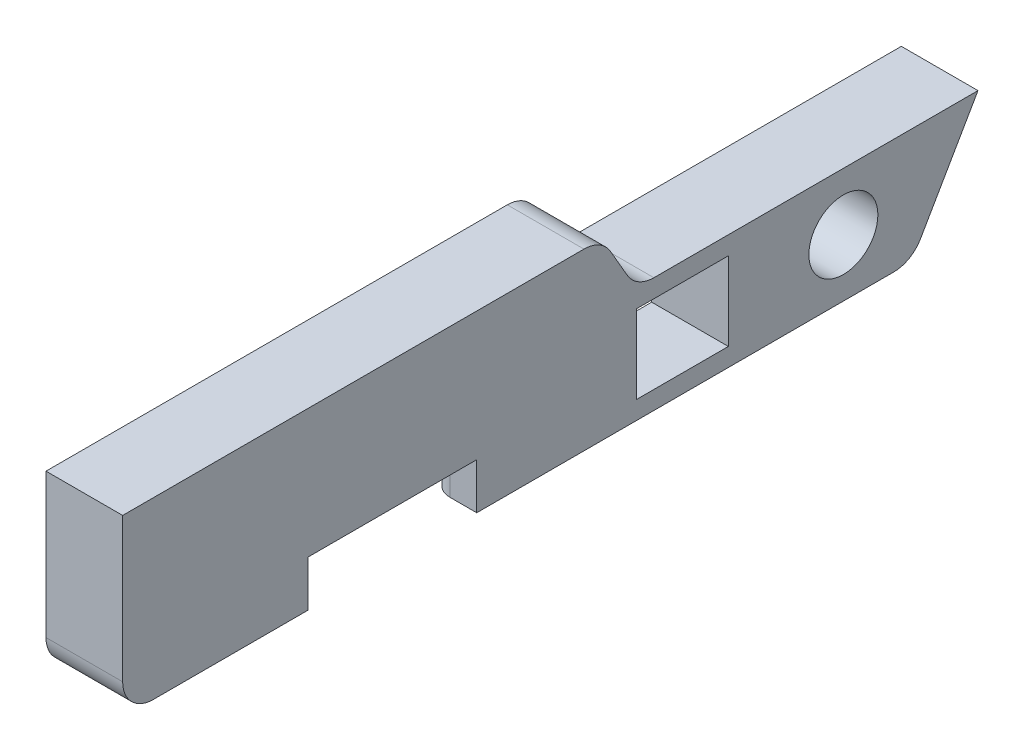
ISO-10303-21;
HEADER;
FILE_DESCRIPTION(('STEP AP214'),'2;1');
FILE_NAME('part.step','',(''),(''),'','','');
FILE_SCHEMA(('AUTOMOTIVE_DESIGN { 1 0 10303 214 1 1 1 1 }'));
ENDSEC;
DATA;
#1=APPLICATION_CONTEXT('core data for automotive mechanical design processes');
#2=APPLICATION_PROTOCOL_DEFINITION('international standard','automotive_design',2000,#1);
#3=PRODUCT_CONTEXT('',#1,'mechanical');
#4=PRODUCT('Part','Part','',(#3));
#5=PRODUCT_RELATED_PRODUCT_CATEGORY('part','',(#4));
#6=PRODUCT_DEFINITION_FORMATION('','',#4);
#7=PRODUCT_DEFINITION_CONTEXT('part definition',#1,'design');
#8=PRODUCT_DEFINITION('design','',#6,#7);
#9=PRODUCT_DEFINITION_SHAPE('','',#8);
#10=(LENGTH_UNIT() NAMED_UNIT(*) SI_UNIT(.MILLI.,.METRE.));
#11=(NAMED_UNIT(*) PLANE_ANGLE_UNIT() SI_UNIT($,.RADIAN.));
#12=(NAMED_UNIT(*) SI_UNIT($,.STERADIAN.) SOLID_ANGLE_UNIT());
#13=UNCERTAINTY_MEASURE_WITH_UNIT(LENGTH_MEASURE(1.E-05),#10,'distance_accuracy_value','');
#14=(GEOMETRIC_REPRESENTATION_CONTEXT(3) GLOBAL_UNCERTAINTY_ASSIGNED_CONTEXT((#13)) GLOBAL_UNIT_ASSIGNED_CONTEXT((#10,
#11,#12)) REPRESENTATION_CONTEXT('',''));
#15=CARTESIAN_POINT('',(0.,0.,0.));
#16=DIRECTION('',(0.,0.,1.));
#17=DIRECTION('',(1.,0.,0.));
#18=AXIS2_PLACEMENT_3D('',#15,#16,#17);
#19=CARTESIAN_POINT('',(6.35,0.,-63.8750303162584));
#20=DIRECTION('',(0.,1.,0.));
#21=DIRECTION('',(0.,0.,1.));
#22=AXIS2_PLACEMENT_3D('',#19,#20,#21);
#23=PLANE('',#22);
#24=DIRECTION('',(0.,0.,-1.));
#25=VECTOR('',#24,1.);
#26=CARTESIAN_POINT('',(0.,0.,-63.8750303162584));
#27=LINE('',#26,#25);
#28=CARTESIAN_POINT('',(0.,0.,-2.54000000000002));
#29=VERTEX_POINT('',#28);
#30=CARTESIAN_POINT('',(0.,0.,-7.41679999999997));
#31=VERTEX_POINT('',#30);
#32=EDGE_CURVE('E353',#29,#31,#27,.T.);
#33=ORIENTED_EDGE('',*,*,#32,.T.);
#34=CARTESIAN_POINT('',(1.5875,0.,-7.41679999999997));
#35=DIRECTION('',(0.,1.,0.));
#36=DIRECTION('',(0.,0.,1.));
#37=AXIS2_PLACEMENT_3D('',#34,#35,#36);
#38=CIRCLE('',#37,1.5875);
#39=CARTESIAN_POINT('',(1.5875,0.,-9.00429999999997));
#40=VERTEX_POINT('',#39);
#41=EDGE_CURVE('E241',#31,#40,#38,.F.);
#42=ORIENTED_EDGE('',*,*,#41,.T.);
#43=DIRECTION('',(-1.,0.,0.));
#44=VECTOR('',#43,1.);
#45=CARTESIAN_POINT('',(2.54,0.,-9.00429999999997));
#46=LINE('',#45,#44);
#47=CARTESIAN_POINT('',(2.54,0.,-9.00429999999997));
#48=VERTEX_POINT('',#47);
#49=EDGE_CURVE('E234',#48,#40,#46,.T.);
#50=ORIENTED_EDGE('',*,*,#49,.F.);
#51=DIRECTION('',(0.,0.,-1.));
#52=VECTOR('',#51,1.);
#53=CARTESIAN_POINT('',(2.54,0.,-9.00429999999997));
#54=LINE('',#53,#52);
#55=CARTESIAN_POINT('',(2.54,0.,-13.7668));
#56=VERTEX_POINT('',#55);
#57=EDGE_CURVE('E217',#48,#56,#54,.T.);
#58=ORIENTED_EDGE('',*,*,#57,.T.);
#59=CARTESIAN_POINT('',(4.1275,0.,-13.7668));
#60=DIRECTION('',(0.,1.,0.));
#61=DIRECTION('',(0.,0.,1.));
#62=AXIS2_PLACEMENT_3D('',#59,#60,#61);
#63=CIRCLE('',#62,1.5875);
#64=CARTESIAN_POINT('',(4.1275,0.,-15.3543));
#65=VERTEX_POINT('',#64);
#66=EDGE_CURVE('E402',#56,#65,#63,.F.);
#67=ORIENTED_EDGE('',*,*,#66,.T.);
#68=DIRECTION('',(1.,0.,0.));
#69=VECTOR('',#68,1.);
#70=CARTESIAN_POINT('',(0.,0.,-15.3543));
#71=LINE('',#70,#69);
#72=CARTESIAN_POINT('',(6.35,0.,-15.3543));
#73=VERTEX_POINT('',#72);
#74=EDGE_CURVE('E274',#65,#73,#71,.T.);
#75=ORIENTED_EDGE('',*,*,#74,.T.);
#76=DIRECTION('',(0.,0.,-1.));
#77=VECTOR('',#76,1.);
#78=CARTESIAN_POINT('',(6.35,0.,-63.8750303162584));
#79=LINE('',#78,#77);
#80=CARTESIAN_POINT('',(6.35,0.,-2.54000000000002));
#81=VERTEX_POINT('',#80);
#82=EDGE_CURVE('E330',#81,#73,#79,.T.);
#83=ORIENTED_EDGE('',*,*,#82,.F.);
#84=DIRECTION('',(-1.,0.,0.));
#85=VECTOR('',#84,1.);
#86=CARTESIAN_POINT('',(6.35,0.,-2.54000000000002));
#87=LINE('',#86,#85);
#88=EDGE_CURVE('E386',#81,#29,#87,.T.);
#89=ORIENTED_EDGE('',*,*,#88,.T.);
#90=EDGE_LOOP('',(#33,#42,#50,#58,#67,#75,#83,#89));
#91=FACE_BOUND('',#90,.T.);
#92=ADVANCED_FACE('F32',(#91),#23,.F.);
#93=DIRECTION('',(-1.,0.,0.));
#94=VECTOR('',#93,1.);
#95=CARTESIAN_POINT('',(2.54,0.,-33.1343));
#96=LINE('',#95,#94);
#97=CARTESIAN_POINT('',(2.54,0.,-33.1343));
#98=VERTEX_POINT('',#97);
#99=CARTESIAN_POINT('',(1.5875,0.,-33.1343));
#100=VERTEX_POINT('',#99);
#101=EDGE_CURVE('E243',#98,#100,#96,.T.);
#102=ORIENTED_EDGE('',*,*,#101,.T.);
#103=CARTESIAN_POINT('',(1.5875,0.,-34.7218));
#104=DIRECTION('',(0.,1.,0.));
#105=DIRECTION('',(0.,0.,1.));
#106=AXIS2_PLACEMENT_3D('',#103,#104,#105);
#107=CIRCLE('',#106,1.5875);
#108=CARTESIAN_POINT('',(0.,0.,-34.7218));
#109=VERTEX_POINT('',#108);
#110=EDGE_CURVE('E413',#100,#109,#107,.F.);
#111=ORIENTED_EDGE('',*,*,#110,.T.);
#112=CARTESIAN_POINT('',(0.,0.,-63.8750303162584));
#113=VERTEX_POINT('',#112);
#114=EDGE_CURVE('E352',#109,#113,#27,.T.);
#115=ORIENTED_EDGE('',*,*,#114,.T.);
#116=DIRECTION('',(-1.,0.,0.));
#117=VECTOR('',#116,1.);
#118=CARTESIAN_POINT('',(6.35,0.,-63.8750303162584));
#119=LINE('',#118,#117);
#120=CARTESIAN_POINT('',(6.35,0.,-63.8750303162584));
#121=VERTEX_POINT('',#120);
#122=EDGE_CURVE('E383',#121,#113,#119,.T.);
#123=ORIENTED_EDGE('',*,*,#122,.F.);
#124=CARTESIAN_POINT('',(6.35,0.,-29.3243));
#125=VERTEX_POINT('',#124);
#126=EDGE_CURVE('E329',#125,#121,#79,.T.);
#127=ORIENTED_EDGE('',*,*,#126,.F.);
#128=DIRECTION('',(1.,0.,0.));
#129=VECTOR('',#128,1.);
#130=CARTESIAN_POINT('',(0.,0.,-29.3243));
#131=LINE('',#130,#129);
#132=CARTESIAN_POINT('',(4.1275,0.,-29.3243));
#133=VERTEX_POINT('',#132);
#134=EDGE_CURVE('E280',#133,#125,#131,.T.);
#135=ORIENTED_EDGE('',*,*,#134,.F.);
#136=CARTESIAN_POINT('',(4.1275,0.,-30.9118));
#137=DIRECTION('',(0.,1.,0.));
#138=DIRECTION('',(0.,0.,1.));
#139=AXIS2_PLACEMENT_3D('',#136,#137,#138);
#140=CIRCLE('',#139,1.5875);
#141=CARTESIAN_POINT('',(2.54,0.,-30.9118));
#142=VERTEX_POINT('',#141);
#143=EDGE_CURVE('E411',#133,#142,#140,.F.);
#144=ORIENTED_EDGE('',*,*,#143,.T.);
#145=EDGE_CURVE('E228',#142,#98,#54,.T.);
#146=ORIENTED_EDGE('',*,*,#145,.T.);
#147=EDGE_LOOP('',(#102,#111,#115,#123,#127,#135,#144,#146));
#148=FACE_BOUND('',#147,.T.);
#149=ADVANCED_FACE('F479',(#148),#23,.F.);
#150=CARTESIAN_POINT('',(0.,11.9343351826281,-38.2059424427617));
#151=DIRECTION('',(-1.,0.,0.));
#152=DIRECTION('',(0.,0.,1.));
#153=AXIS2_PLACEMENT_3D('',#150,#151,#152);
#154=PLANE('',#153);
#155=DIRECTION('',(0.,-1.,0.));
#156=VECTOR('',#155,1.);
#157=CARTESIAN_POINT('',(0.,8.0137,-42.545));
#158=LINE('',#157,#156);
#159=CARTESIAN_POINT('',(0.,8.0137,-42.545));
#160=VERTEX_POINT('',#159);
#161=CARTESIAN_POINT('',(0.,1.5113,-42.545));
#162=VERTEX_POINT('',#161);
#163=EDGE_CURVE('E289',#160,#162,#158,.T.);
#164=ORIENTED_EDGE('',*,*,#163,.T.);
#165=DIRECTION('',(0.,0.,-1.));
#166=VECTOR('',#165,1.);
#167=CARTESIAN_POINT('',(0.,1.5113,-42.545));
#168=LINE('',#167,#166);
#169=CARTESIAN_POINT('',(0.,1.5113,-50.165));
#170=VERTEX_POINT('',#169);
#171=EDGE_CURVE('E292',#162,#170,#168,.T.);
#172=ORIENTED_EDGE('',*,*,#171,.T.);
#173=DIRECTION('',(0.,1.,0.));
#174=VECTOR('',#173,1.);
#175=CARTESIAN_POINT('',(0.,8.0137,-50.165));
#176=LINE('',#175,#174);
#177=CARTESIAN_POINT('',(0.,8.0137,-50.165));
#178=VERTEX_POINT('',#177);
#179=EDGE_CURVE('E296',#170,#178,#176,.T.);
#180=ORIENTED_EDGE('',*,*,#179,.T.);
#181=DIRECTION('',(0.,0.,1.));
#182=VECTOR('',#181,1.);
#183=CARTESIAN_POINT('',(0.,8.0137,-42.545));
#184=LINE('',#183,#182);
#185=EDGE_CURVE('E299',#178,#160,#184,.T.);
#186=ORIENTED_EDGE('',*,*,#185,.T.);
#187=EDGE_LOOP('',(#164,#172,#180,#186));
#188=FACE_BOUND('',#187,.T.);
#189=CARTESIAN_POINT('',(0.,4.7625,-59.69));
#190=DIRECTION('',(1.,0.,0.));
#191=DIRECTION('',(0.,0.,-1.));
#192=AXIS2_PLACEMENT_3D('',#189,#190,#191);
#193=CIRCLE('',#192,2.85749999999999);
#194=CARTESIAN_POINT('',(0.,4.7625,-62.5475));
#195=VERTEX_POINT('',#194);
#196=EDGE_CURVE('E283',#195,#195,#193,.T.);
#197=ORIENTED_EDGE('',*,*,#196,.T.);
#198=EDGE_LOOP('',(#197));
#199=FACE_BOUND('',#198,.T.);
#200=DIRECTION('',(0.,0.,1.));
#201=VECTOR('',#200,1.);
#202=CARTESIAN_POINT('',(0.,13.2691648721594,-38.2059424427617));
#203=LINE('',#202,#201);
#204=CARTESIAN_POINT('',(0.,13.2691648721594,-34.7218));
#205=VERTEX_POINT('',#204);
#206=CARTESIAN_POINT('',(0.,13.2691648721594,-7.41679999999997));
#207=VERTEX_POINT('',#206);
#208=EDGE_CURVE('E397',#205,#207,#203,.T.);
#209=ORIENTED_EDGE('',*,*,#208,.T.);
#210=DIRECTION('',(0.,-1.,0.));
#211=VECTOR('',#210,1.);
#212=CARTESIAN_POINT('',(0.,11.9343351826281,-7.41679999999997));
#213=LINE('',#212,#211);
#214=EDGE_CURVE('E399',#207,#31,#213,.T.);
#215=ORIENTED_EDGE('',*,*,#214,.T.);
#216=ORIENTED_EDGE('',*,*,#32,.F.);
#217=CARTESIAN_POINT('',(0.,2.54,-2.54));
#218=DIRECTION('',(1.,0.,0.));
#219=DIRECTION('',(0.,0.,-1.));
#220=AXIS2_PLACEMENT_3D('',#217,#218,#219);
#221=CIRCLE('',#220,2.54);
#222=CARTESIAN_POINT('',(0.,2.54000000000002,0.));
#223=VERTEX_POINT('',#222);
#224=EDGE_CURVE('E350',#223,#29,#221,.T.);
#225=ORIENTED_EDGE('',*,*,#224,.F.);
#226=DIRECTION('',(0.,-1.,0.));
#227=VECTOR('',#226,1.);
#228=CARTESIAN_POINT('',(0.,2.54000000000002,0.));
#229=LINE('',#228,#227);
#230=CARTESIAN_POINT('',(0.,14.4743351826281,0.));
#231=VERTEX_POINT('',#230);
#232=EDGE_CURVE('E348',#231,#223,#229,.T.);
#233=ORIENTED_EDGE('',*,*,#232,.F.);
#234=DIRECTION('',(0.,0.,1.));
#235=VECTOR('',#234,1.);
#236=CARTESIAN_POINT('',(0.,14.4743351826281,0.));
#237=LINE('',#236,#235);
#238=CARTESIAN_POINT('',(0.,14.4743351826281,-38.2059424427617));
#239=VERTEX_POINT('',#238);
#240=EDGE_CURVE('E314',#239,#231,#237,.T.);
#241=ORIENTED_EDGE('',*,*,#240,.F.);
#242=CARTESIAN_POINT('',(0.,11.9343351826281,-38.2059424427617));
#243=DIRECTION('',(1.,0.,0.));
#244=DIRECTION('',(0.,0.,1.));
#245=AXIS2_PLACEMENT_3D('',#242,#243,#244);
#246=CIRCLE('',#245,2.54);
#247=CARTESIAN_POINT('',(0.,13.2043351826281,-40.4056469683742));
#248=VERTEX_POINT('',#247);
#249=EDGE_CURVE('E325',#248,#239,#246,.T.);
#250=ORIENTED_EDGE('',*,*,#249,.F.);
#251=DIRECTION('',(0.,0.866025403784438,0.500000000000001));
#252=VECTOR('',#251,1.);
#253=CARTESIAN_POINT('',(0.,13.2043351826281,-40.4056469683742));
#254=LINE('',#253,#252);
#255=CARTESIAN_POINT('',(0.,10.795,-41.7966772846325));
#256=VERTEX_POINT('',#255);
#257=EDGE_CURVE('E363',#256,#248,#254,.T.);
#258=ORIENTED_EDGE('',*,*,#257,.F.);
#259=CARTESIAN_POINT('',(0.,12.065,-43.996381810245));
#260=DIRECTION('',(-1.,0.,0.));
#261=DIRECTION('',(0.,0.,-1.));
#262=AXIS2_PLACEMENT_3D('',#259,#260,#261);
#263=CIRCLE('',#262,2.54);
#264=CARTESIAN_POINT('',(0.,9.525,-43.996381810245));
#265=VERTEX_POINT('',#264);
#266=EDGE_CURVE('E361',#265,#256,#263,.T.);
#267=ORIENTED_EDGE('',*,*,#266,.F.);
#268=DIRECTION('',(0.,0.,1.));
#269=VECTOR('',#268,1.);
#270=CARTESIAN_POINT('',(0.,9.525,-43.996381810245));
#271=LINE('',#270,#269);
#272=CARTESIAN_POINT('',(0.,9.525,-70.8407613140312));
#273=VERTEX_POINT('',#272);
#274=EDGE_CURVE('E359',#273,#265,#271,.T.);
#275=ORIENTED_EDGE('',*,*,#274,.F.);
#276=DIRECTION('',(0.,0.866025403784439,-0.5));
#277=VECTOR('',#276,1.);
#278=CARTESIAN_POINT('',(0.,9.525,-70.8407613140312));
#279=LINE('',#278,#277);
#280=CARTESIAN_POINT('',(0.,1.27,-66.0747348418709));
#281=VERTEX_POINT('',#280);
#282=EDGE_CURVE('E357',#281,#273,#279,.T.);
#283=ORIENTED_EDGE('',*,*,#282,.F.);
#284=CARTESIAN_POINT('',(0.,2.54,-63.8750303162584));
#285=DIRECTION('',(1.,0.,0.));
#286=DIRECTION('',(0.,0.,1.));
#287=AXIS2_PLACEMENT_3D('',#284,#285,#286);
#288=CIRCLE('',#287,2.54);
#289=EDGE_CURVE('E355',#113,#281,#288,.T.);
#290=ORIENTED_EDGE('',*,*,#289,.F.);
#291=ORIENTED_EDGE('',*,*,#114,.F.);
#292=DIRECTION('',(0.,1.,0.));
#293=VECTOR('',#292,1.);
#294=CARTESIAN_POINT('',(0.,11.9343351826281,-34.7218));
#295=LINE('',#294,#293);
#296=EDGE_CURVE('E395',#109,#205,#295,.T.);
#297=ORIENTED_EDGE('',*,*,#296,.T.);
#298=EDGE_LOOP('',(#209,#215,#216,#225,#233,#241,#250,#258,#267,#275,#283,#290,#291,#297));
#299=FACE_BOUND('',#298,.T.);
#300=ADVANCED_FACE('F453',(#188,#199,#299),#154,.T.);
#301=CARTESIAN_POINT('',(0.,3.81,-15.3543));
#302=DIRECTION('',(0.,1.,0.));
#303=DIRECTION('',(0.,0.,1.));
#304=AXIS2_PLACEMENT_3D('',#301,#302,#303);
#305=PLANE('',#304);
#306=DIRECTION('',(0.,0.,-1.));
#307=VECTOR('',#306,1.);
#308=CARTESIAN_POINT('',(5.334,3.81,-7.98829999999997));
#309=LINE('',#308,#307);
#310=CARTESIAN_POINT('',(5.334,3.81,-15.3543));
#311=VERTEX_POINT('',#310);
#312=CARTESIAN_POINT('',(5.334,3.81,-29.3243));
#313=VERTEX_POINT('',#312);
#314=EDGE_CURVE('E242',#311,#313,#309,.T.);
#315=ORIENTED_EDGE('',*,*,#314,.T.);
#316=DIRECTION('',(1.,0.,0.));
#317=VECTOR('',#316,1.);
#318=CARTESIAN_POINT('',(0.,3.81,-29.3243));
#319=LINE('',#318,#317);
#320=CARTESIAN_POINT('',(6.35,3.81,-29.3243));
#321=VERTEX_POINT('',#320);
#322=EDGE_CURVE('E278',#313,#321,#319,.T.);
#323=ORIENTED_EDGE('',*,*,#322,.T.);
#324=DIRECTION('',(0.,0.,1.));
#325=VECTOR('',#324,1.);
#326=CARTESIAN_POINT('',(6.35,3.81,-15.3543));
#327=LINE('',#326,#325);
#328=CARTESIAN_POINT('',(6.35,3.81,-15.3543));
#329=VERTEX_POINT('',#328);
#330=EDGE_CURVE('E271',#321,#329,#327,.T.);
#331=ORIENTED_EDGE('',*,*,#330,.T.);
#332=DIRECTION('',(1.,0.,0.));
#333=VECTOR('',#332,1.);
#334=CARTESIAN_POINT('',(0.,3.81,-15.3543));
#335=LINE('',#334,#333);
#336=EDGE_CURVE('E275',#311,#329,#335,.T.);
#337=ORIENTED_EDGE('',*,*,#336,.F.);
#338=EDGE_LOOP('',(#315,#323,#331,#337));
#339=FACE_BOUND('',#338,.T.);
#340=ADVANCED_FACE('F495',(#339),#305,.F.);
#341=CARTESIAN_POINT('',(6.35,14.4743351826281,0.));
#342=DIRECTION('',(0.,-1.,0.));
#343=DIRECTION('',(0.,0.,-1.));
#344=AXIS2_PLACEMENT_3D('',#341,#342,#343);
#345=PLANE('',#344);
#346=ORIENTED_EDGE('',*,*,#240,.T.);
#347=DIRECTION('',(-1.,0.,0.));
#348=VECTOR('',#347,1.);
#349=CARTESIAN_POINT('',(6.35,14.4743351826281,0.));
#350=LINE('',#349,#348);
#351=CARTESIAN_POINT('',(6.35,14.4743351826281,0.));
#352=VERTEX_POINT('',#351);
#353=EDGE_CURVE('E392',#352,#231,#350,.T.);
#354=ORIENTED_EDGE('',*,*,#353,.F.);
#355=DIRECTION('',(0.,0.,1.));
#356=VECTOR('',#355,1.);
#357=CARTESIAN_POINT('',(6.35,14.4743351826281,0.));
#358=LINE('',#357,#356);
#359=CARTESIAN_POINT('',(6.35,14.4743351826281,-38.2059424427617));
#360=VERTEX_POINT('',#359);
#361=EDGE_CURVE('E321',#360,#352,#358,.T.);
#362=ORIENTED_EDGE('',*,*,#361,.F.);
#363=DIRECTION('',(-1.,0.,0.));
#364=VECTOR('',#363,1.);
#365=CARTESIAN_POINT('',(6.35,14.4743351826281,-38.2059424427617));
#366=LINE('',#365,#364);
#367=EDGE_CURVE('E345',#360,#239,#366,.T.);
#368=ORIENTED_EDGE('',*,*,#367,.T.);
#369=EDGE_LOOP('',(#346,#354,#362,#368));
#370=FACE_BOUND('',#369,.T.);
#371=ADVANCED_FACE('F525',(#370),#345,.F.);
#372=CARTESIAN_POINT('',(6.35,2.54000000000002,0.));
#373=DIRECTION('',(0.,0.,-1.));
#374=DIRECTION('',(-1.,0.,0.));
#375=AXIS2_PLACEMENT_3D('',#372,#373,#374);
#376=PLANE('',#375);
#377=ORIENTED_EDGE('',*,*,#232,.T.);
#378=DIRECTION('',(-1.,0.,0.));
#379=VECTOR('',#378,1.);
#380=CARTESIAN_POINT('',(6.35,2.54000000000002,0.));
#381=LINE('',#380,#379);
#382=CARTESIAN_POINT('',(6.35,2.54000000000002,0.));
#383=VERTEX_POINT('',#382);
#384=EDGE_CURVE('E389',#383,#223,#381,.T.);
#385=ORIENTED_EDGE('',*,*,#384,.F.);
#386=DIRECTION('',(0.,-1.,0.));
#387=VECTOR('',#386,1.);
#388=CARTESIAN_POINT('',(6.35,2.54000000000002,0.));
#389=LINE('',#388,#387);
#390=EDGE_CURVE('E324',#352,#383,#389,.T.);
#391=ORIENTED_EDGE('',*,*,#390,.F.);
#392=ORIENTED_EDGE('',*,*,#353,.T.);
#393=EDGE_LOOP('',(#377,#385,#391,#392));
#394=FACE_BOUND('',#393,.T.);
#395=ADVANCED_FACE('F522',(#394),#376,.F.);
#396=CARTESIAN_POINT('',(6.35,2.54,-2.54));
#397=DIRECTION('',(-1.,0.,0.));
#398=DIRECTION('',(0.,0.,1.));
#399=AXIS2_PLACEMENT_3D('',#396,#397,#398);
#400=CYLINDRICAL_SURFACE('',#399,2.54);
#401=ORIENTED_EDGE('',*,*,#224,.T.);
#402=ORIENTED_EDGE('',*,*,#88,.F.);
#403=CARTESIAN_POINT('',(6.35,2.54,-2.54));
#404=DIRECTION('',(1.,0.,0.));
#405=DIRECTION('',(0.,0.,-1.));
#406=AXIS2_PLACEMENT_3D('',#403,#404,#405);
#407=CIRCLE('',#406,2.54);
#408=EDGE_CURVE('E327',#383,#81,#407,.T.);
#409=ORIENTED_EDGE('',*,*,#408,.F.);
#410=ORIENTED_EDGE('',*,*,#384,.T.);
#411=EDGE_LOOP('',(#401,#402,#409,#410));
#412=FACE_BOUND('',#411,.T.);
#413=ADVANCED_FACE('F519',(#412),#400,.T.);
#414=CARTESIAN_POINT('',(6.35,2.54,-63.8750303162584));
#415=DIRECTION('',(-1.,0.,0.));
#416=DIRECTION('',(0.,0.,1.));
#417=AXIS2_PLACEMENT_3D('',#414,#415,#416);
#418=CYLINDRICAL_SURFACE('',#417,2.54);
#419=ORIENTED_EDGE('',*,*,#289,.T.);
#420=DIRECTION('',(-1.,0.,0.));
#421=VECTOR('',#420,1.);
#422=CARTESIAN_POINT('',(6.35,1.27,-66.0747348418709));
#423=LINE('',#422,#421);
#424=CARTESIAN_POINT('',(6.35,1.27,-66.0747348418709));
#425=VERTEX_POINT('',#424);
#426=EDGE_CURVE('E380',#425,#281,#423,.T.);
#427=ORIENTED_EDGE('',*,*,#426,.F.);
#428=CARTESIAN_POINT('',(6.35,2.54,-63.8750303162584));
#429=DIRECTION('',(1.,0.,0.));
#430=DIRECTION('',(0.,0.,1.));
#431=AXIS2_PLACEMENT_3D('',#428,#429,#430);
#432=CIRCLE('',#431,2.54);
#433=EDGE_CURVE('E333',#121,#425,#432,.T.);
#434=ORIENTED_EDGE('',*,*,#433,.F.);
#435=ORIENTED_EDGE('',*,*,#122,.T.);
#436=EDGE_LOOP('',(#419,#427,#434,#435));
#437=FACE_BOUND('',#436,.T.);
#438=ADVANCED_FACE('F517',(#437),#418,.T.);
#439=CARTESIAN_POINT('',(6.35,9.525,-70.8407613140312));
#440=DIRECTION('',(0.,0.5,0.866025403784439));
#441=DIRECTION('',(0.,-0.866025403784439,0.5));
#442=AXIS2_PLACEMENT_3D('',#439,#440,#441);
#443=PLANE('',#442);
#444=ORIENTED_EDGE('',*,*,#282,.T.);
#445=DIRECTION('',(-1.,0.,0.));
#446=VECTOR('',#445,1.);
#447=CARTESIAN_POINT('',(6.35,9.525,-70.8407613140312));
#448=LINE('',#447,#446);
#449=CARTESIAN_POINT('',(6.35,9.525,-70.8407613140312));
#450=VERTEX_POINT('',#449);
#451=EDGE_CURVE('E377',#450,#273,#448,.T.);
#452=ORIENTED_EDGE('',*,*,#451,.F.);
#453=DIRECTION('',(0.,0.866025403784439,-0.5));
#454=VECTOR('',#453,1.);
#455=CARTESIAN_POINT('',(6.35,9.525,-70.8407613140312));
#456=LINE('',#455,#454);
#457=EDGE_CURVE('E335',#425,#450,#456,.T.);
#458=ORIENTED_EDGE('',*,*,#457,.F.);
#459=ORIENTED_EDGE('',*,*,#426,.T.);
#460=EDGE_LOOP('',(#444,#452,#458,#459));
#461=FACE_BOUND('',#460,.T.);
#462=ADVANCED_FACE('F730',(#461),#443,.F.);
#463=CARTESIAN_POINT('',(6.35,9.525,-43.996381810245));
#464=DIRECTION('',(0.,-1.,0.));
#465=DIRECTION('',(0.,0.,-1.));
#466=AXIS2_PLACEMENT_3D('',#463,#464,#465);
#467=PLANE('',#466);
#468=ORIENTED_EDGE('',*,*,#274,.T.);
#469=DIRECTION('',(-1.,0.,0.));
#470=VECTOR('',#469,1.);
#471=CARTESIAN_POINT('',(6.35,9.525,-43.996381810245));
#472=LINE('',#471,#470);
#473=CARTESIAN_POINT('',(6.35,9.525,-43.996381810245));
#474=VERTEX_POINT('',#473);
#475=EDGE_CURVE('E374',#474,#265,#472,.T.);
#476=ORIENTED_EDGE('',*,*,#475,.F.);
#477=DIRECTION('',(0.,0.,1.));
#478=VECTOR('',#477,1.);
#479=CARTESIAN_POINT('',(6.35,9.525,-43.996381810245));
#480=LINE('',#479,#478);
#481=EDGE_CURVE('E337',#450,#474,#480,.T.);
#482=ORIENTED_EDGE('',*,*,#481,.F.);
#483=ORIENTED_EDGE('',*,*,#451,.T.);
#484=EDGE_LOOP('',(#468,#476,#482,#483));
#485=FACE_BOUND('',#484,.T.);
#486=ADVANCED_FACE('F720',(#485),#467,.F.);
#487=CARTESIAN_POINT('',(6.35,12.065,-43.996381810245));
#488=DIRECTION('',(-1.,0.,0.));
#489=DIRECTION('',(0.,0.,1.));
#490=AXIS2_PLACEMENT_3D('',#487,#488,#489);
#491=CYLINDRICAL_SURFACE('',#490,2.54);
#492=ORIENTED_EDGE('',*,*,#266,.T.);
#493=DIRECTION('',(-1.,0.,0.));
#494=VECTOR('',#493,1.);
#495=CARTESIAN_POINT('',(6.35,10.795,-41.7966772846325));
#496=LINE('',#495,#494);
#497=CARTESIAN_POINT('',(6.35,10.795,-41.7966772846325));
#498=VERTEX_POINT('',#497);
#499=EDGE_CURVE('E371',#498,#256,#496,.T.);
#500=ORIENTED_EDGE('',*,*,#499,.F.);
#501=CARTESIAN_POINT('',(6.35,12.065,-43.996381810245));
#502=DIRECTION('',(-1.,0.,0.));
#503=DIRECTION('',(0.,0.,-1.));
#504=AXIS2_PLACEMENT_3D('',#501,#502,#503);
#505=CIRCLE('',#504,2.54);
#506=EDGE_CURVE('E339',#474,#498,#505,.T.);
#507=ORIENTED_EDGE('',*,*,#506,.F.);
#508=ORIENTED_EDGE('',*,*,#475,.T.);
#509=EDGE_LOOP('',(#492,#500,#507,#508));
#510=FACE_BOUND('',#509,.T.);
#511=ADVANCED_FACE('F710',(#510),#491,.F.);
#512=CARTESIAN_POINT('',(6.35,13.2043351826281,-40.4056469683742));
#513=DIRECTION('',(0.,-0.500000000000001,0.866025403784438));
#514=DIRECTION('',(0.,-0.866025403784438,-0.500000000000001));
#515=AXIS2_PLACEMENT_3D('',#512,#513,#514);
#516=PLANE('',#515);
#517=ORIENTED_EDGE('',*,*,#257,.T.);
#518=DIRECTION('',(-1.,0.,0.));
#519=VECTOR('',#518,1.);
#520=CARTESIAN_POINT('',(6.35,13.2043351826281,-40.4056469683742));
#521=LINE('',#520,#519);
#522=CARTESIAN_POINT('',(6.35,13.2043351826281,-40.4056469683742));
#523=VERTEX_POINT('',#522);
#524=EDGE_CURVE('E368',#523,#248,#521,.T.);
#525=ORIENTED_EDGE('',*,*,#524,.F.);
#526=DIRECTION('',(0.,0.866025403784438,0.500000000000001));
#527=VECTOR('',#526,1.);
#528=CARTESIAN_POINT('',(6.35,13.2043351826281,-40.4056469683742));
#529=LINE('',#528,#527);
#530=EDGE_CURVE('E341',#498,#523,#529,.T.);
#531=ORIENTED_EDGE('',*,*,#530,.F.);
#532=ORIENTED_EDGE('',*,*,#499,.T.);
#533=EDGE_LOOP('',(#517,#525,#531,#532));
#534=FACE_BOUND('',#533,.T.);
#535=ADVANCED_FACE('F700',(#534),#516,.F.);
#536=CARTESIAN_POINT('',(6.35,11.9343351826281,-38.2059424427617));
#537=DIRECTION('',(-1.,0.,0.));
#538=DIRECTION('',(0.,0.,1.));
#539=AXIS2_PLACEMENT_3D('',#536,#537,#538);
#540=CYLINDRICAL_SURFACE('',#539,2.54);
#541=ORIENTED_EDGE('',*,*,#249,.T.);
#542=ORIENTED_EDGE('',*,*,#367,.F.);
#543=CARTESIAN_POINT('',(6.35,11.9343351826281,-38.2059424427617));
#544=DIRECTION('',(1.,0.,0.));
#545=DIRECTION('',(0.,0.,1.));
#546=AXIS2_PLACEMENT_3D('',#543,#544,#545);
#547=CIRCLE('',#546,2.54);
#548=EDGE_CURVE('E343',#523,#360,#547,.T.);
#549=ORIENTED_EDGE('',*,*,#548,.F.);
#550=ORIENTED_EDGE('',*,*,#524,.T.);
#551=EDGE_LOOP('',(#541,#542,#549,#550));
#552=FACE_BOUND('',#551,.T.);
#553=ADVANCED_FACE('F690',(#552),#540,.T.);
#554=CARTESIAN_POINT('',(6.35,11.9343351826281,-38.2059424427617));
#555=DIRECTION('',(-1.,0.,0.));
#556=DIRECTION('',(0.,0.,1.));
#557=AXIS2_PLACEMENT_3D('',#554,#555,#556);
#558=PLANE('',#557);
#559=CARTESIAN_POINT('',(6.35,4.7625,-59.69));
#560=DIRECTION('',(1.,0.,0.));
#561=DIRECTION('',(0.,0.,-1.));
#562=AXIS2_PLACEMENT_3D('',#559,#560,#561);
#563=CIRCLE('',#562,2.85749999999999);
#564=CARTESIAN_POINT('',(6.35,4.7625,-62.5475));
#565=VERTEX_POINT('',#564);
#566=EDGE_CURVE('E277',#565,#565,#563,.T.);
#567=ORIENTED_EDGE('',*,*,#566,.F.);
#568=EDGE_LOOP('',(#567));
#569=FACE_BOUND('',#568,.T.);
#570=DIRECTION('',(0.,0.,-1.));
#571=VECTOR('',#570,1.);
#572=CARTESIAN_POINT('',(6.35,1.5113,-42.545));
#573=LINE('',#572,#571);
#574=CARTESIAN_POINT('',(6.35,1.5113,-42.545));
#575=VERTEX_POINT('',#574);
#576=CARTESIAN_POINT('',(6.35,1.5113,-50.165));
#577=VERTEX_POINT('',#576);
#578=EDGE_CURVE('E304',#575,#577,#573,.T.);
#579=ORIENTED_EDGE('',*,*,#578,.F.);
#580=DIRECTION('',(0.,-1.,0.));
#581=VECTOR('',#580,1.);
#582=CARTESIAN_POINT('',(6.35,8.0137,-42.545));
#583=LINE('',#582,#581);
#584=CARTESIAN_POINT('',(6.35,8.0137,-42.545));
#585=VERTEX_POINT('',#584);
#586=EDGE_CURVE('E286',#585,#575,#583,.T.);
#587=ORIENTED_EDGE('',*,*,#586,.F.);
#588=DIRECTION('',(0.,0.,1.));
#589=VECTOR('',#588,1.);
#590=CARTESIAN_POINT('',(6.35,8.0137,-42.545));
#591=LINE('',#590,#589);
#592=CARTESIAN_POINT('',(6.35,8.0137,-50.165));
#593=VERTEX_POINT('',#592);
#594=EDGE_CURVE('E293',#593,#585,#591,.T.);
#595=ORIENTED_EDGE('',*,*,#594,.F.);
#596=DIRECTION('',(0.,1.,0.));
#597=VECTOR('',#596,1.);
#598=CARTESIAN_POINT('',(6.35,8.0137,-50.165));
#599=LINE('',#598,#597);
#600=EDGE_CURVE('E307',#577,#593,#599,.T.);
#601=ORIENTED_EDGE('',*,*,#600,.F.);
#602=EDGE_LOOP('',(#579,#587,#595,#601));
#603=FACE_BOUND('',#602,.T.);
#604=ORIENTED_EDGE('',*,*,#82,.T.);
#605=DIRECTION('',(0.,-1.,0.));
#606=VECTOR('',#605,1.);
#607=CARTESIAN_POINT('',(6.35,0.,-15.3543));
#608=LINE('',#607,#606);
#609=EDGE_CURVE('E262',#329,#73,#608,.T.);
#610=ORIENTED_EDGE('',*,*,#609,.F.);
#611=ORIENTED_EDGE('',*,*,#330,.F.);
#612=DIRECTION('',(0.,1.,0.));
#613=VECTOR('',#612,1.);
#614=CARTESIAN_POINT('',(6.35,0.,-29.3243));
#615=LINE('',#614,#613);
#616=EDGE_CURVE('E268',#125,#321,#615,.T.);
#617=ORIENTED_EDGE('',*,*,#616,.F.);
#618=ORIENTED_EDGE('',*,*,#126,.T.);
#619=ORIENTED_EDGE('',*,*,#433,.T.);
#620=ORIENTED_EDGE('',*,*,#457,.T.);
#621=ORIENTED_EDGE('',*,*,#481,.T.);
#622=ORIENTED_EDGE('',*,*,#506,.T.);
#623=ORIENTED_EDGE('',*,*,#530,.T.);
#624=ORIENTED_EDGE('',*,*,#548,.T.);
#625=ORIENTED_EDGE('',*,*,#361,.T.);
#626=ORIENTED_EDGE('',*,*,#390,.T.);
#627=ORIENTED_EDGE('',*,*,#408,.T.);
#628=EDGE_LOOP('',(#604,#610,#611,#617,#618,#619,#620,#621,#622,#623,#624,#625,#626,#627));
#629=FACE_BOUND('',#628,.T.);
#630=ADVANCED_FACE('F446',(#569,#603,#629),#558,.F.);
#631=CARTESIAN_POINT('',(0.,8.0137,-42.545));
#632=DIRECTION('',(0.,0.,1.));
#633=DIRECTION('',(1.,0.,0.));
#634=AXIS2_PLACEMENT_3D('',#631,#632,#633);
#635=PLANE('',#634);
#636=ORIENTED_EDGE('',*,*,#586,.T.);
#637=DIRECTION('',(1.,0.,0.));
#638=VECTOR('',#637,1.);
#639=CARTESIAN_POINT('',(0.,1.5113,-42.545));
#640=LINE('',#639,#638);
#641=EDGE_CURVE('E302',#162,#575,#640,.T.);
#642=ORIENTED_EDGE('',*,*,#641,.F.);
#643=ORIENTED_EDGE('',*,*,#163,.F.);
#644=DIRECTION('',(1.,0.,0.));
#645=VECTOR('',#644,1.);
#646=CARTESIAN_POINT('',(0.,8.0137,-42.545));
#647=LINE('',#646,#645);
#648=EDGE_CURVE('E312',#160,#585,#647,.T.);
#649=ORIENTED_EDGE('',*,*,#648,.T.);
#650=EDGE_LOOP('',(#636,#642,#643,#649));
#651=FACE_BOUND('',#650,.T.);
#652=ADVANCED_FACE('F671',(#651),#635,.F.);
#653=CARTESIAN_POINT('',(0.,8.0137,-42.545));
#654=DIRECTION('',(0.,1.,0.));
#655=DIRECTION('',(0.,0.,1.));
#656=AXIS2_PLACEMENT_3D('',#653,#654,#655);
#657=PLANE('',#656);
#658=ORIENTED_EDGE('',*,*,#594,.T.);
#659=ORIENTED_EDGE('',*,*,#648,.F.);
#660=ORIENTED_EDGE('',*,*,#185,.F.);
#661=DIRECTION('',(1.,0.,0.));
#662=VECTOR('',#661,1.);
#663=CARTESIAN_POINT('',(0.,8.0137,-50.165));
#664=LINE('',#663,#662);
#665=EDGE_CURVE('E315',#178,#593,#664,.T.);
#666=ORIENTED_EDGE('',*,*,#665,.T.);
#667=EDGE_LOOP('',(#658,#659,#660,#666));
#668=FACE_BOUND('',#667,.T.);
#669=ADVANCED_FACE('F661',(#668),#657,.F.);
#670=CARTESIAN_POINT('',(0.,8.0137,-50.165));
#671=DIRECTION('',(0.,0.,-1.));
#672=DIRECTION('',(-1.,0.,0.));
#673=AXIS2_PLACEMENT_3D('',#670,#671,#672);
#674=PLANE('',#673);
#675=ORIENTED_EDGE('',*,*,#600,.T.);
#676=ORIENTED_EDGE('',*,*,#665,.F.);
#677=ORIENTED_EDGE('',*,*,#179,.F.);
#678=DIRECTION('',(1.,0.,0.));
#679=VECTOR('',#678,1.);
#680=CARTESIAN_POINT('',(0.,1.5113,-50.165));
#681=LINE('',#680,#679);
#682=EDGE_CURVE('E317',#170,#577,#681,.T.);
#683=ORIENTED_EDGE('',*,*,#682,.T.);
#684=EDGE_LOOP('',(#675,#676,#677,#683));
#685=FACE_BOUND('',#684,.T.);
#686=ADVANCED_FACE('F651',(#685),#674,.F.);
#687=CARTESIAN_POINT('',(0.,1.5113,-42.545));
#688=DIRECTION('',(0.,-1.,0.));
#689=DIRECTION('',(0.,0.,-1.));
#690=AXIS2_PLACEMENT_3D('',#687,#688,#689);
#691=PLANE('',#690);
#692=ORIENTED_EDGE('',*,*,#578,.T.);
#693=ORIENTED_EDGE('',*,*,#682,.F.);
#694=ORIENTED_EDGE('',*,*,#171,.F.);
#695=ORIENTED_EDGE('',*,*,#641,.T.);
#696=EDGE_LOOP('',(#692,#693,#694,#695));
#697=FACE_BOUND('',#696,.T.);
#698=ADVANCED_FACE('F641',(#697),#691,.F.);
#699=CARTESIAN_POINT('',(0.,4.7625,-59.69));
#700=DIRECTION('',(1.,0.,0.));
#701=DIRECTION('',(0.,0.,-1.));
#702=AXIS2_PLACEMENT_3D('',#699,#700,#701);
#703=CYLINDRICAL_SURFACE('',#702,2.85749999999999);
#704=ORIENTED_EDGE('',*,*,#196,.F.);
#705=EDGE_LOOP('',(#704));
#706=FACE_BOUND('',#705,.T.);
#707=ORIENTED_EDGE('',*,*,#566,.T.);
#708=EDGE_LOOP('',(#707));
#709=FACE_BOUND('',#708,.T.);
#710=ADVANCED_FACE('F601',(#706,#709),#703,.F.);
#711=CARTESIAN_POINT('',(0.,0.,-15.3543));
#712=DIRECTION('',(0.,0.,1.));
#713=DIRECTION('',(1.,0.,0.));
#714=AXIS2_PLACEMENT_3D('',#711,#712,#713);
#715=PLANE('',#714);
#716=ORIENTED_EDGE('',*,*,#74,.F.);
#717=DIRECTION('',(0.,1.,0.));
#718=VECTOR('',#717,1.);
#719=CARTESIAN_POINT('',(4.1275,0.,-15.3543));
#720=LINE('',#719,#718);
#721=CARTESIAN_POINT('',(4.1275,8.89,-15.3543));
#722=VERTEX_POINT('',#721);
#723=EDGE_CURVE('E41',#65,#722,#720,.T.);
#724=ORIENTED_EDGE('',*,*,#723,.T.);
#725=DIRECTION('',(-1.,0.,0.));
#726=VECTOR('',#725,1.);
#727=CARTESIAN_POINT('',(0.,8.89,-15.3543));
#728=LINE('',#727,#726);
#729=CARTESIAN_POINT('',(5.334,8.89,-15.3543));
#730=VERTEX_POINT('',#729);
#731=EDGE_CURVE('E260',#730,#722,#728,.T.);
#732=ORIENTED_EDGE('',*,*,#731,.F.);
#733=DIRECTION('',(0.,1.,0.));
#734=VECTOR('',#733,1.);
#735=CARTESIAN_POINT('',(5.334,3.81,-15.3543));
#736=LINE('',#735,#734);
#737=EDGE_CURVE('E256',#311,#730,#736,.T.);
#738=ORIENTED_EDGE('',*,*,#737,.F.);
#739=ORIENTED_EDGE('',*,*,#336,.T.);
#740=ORIENTED_EDGE('',*,*,#609,.T.);
#741=EDGE_LOOP('',(#716,#724,#732,#738,#739,#740));
#742=FACE_BOUND('',#741,.T.);
#743=ADVANCED_FACE('F440',(#742),#715,.F.);
#744=CARTESIAN_POINT('',(0.,0.,-29.3243));
#745=DIRECTION('',(0.,0.,-1.));
#746=DIRECTION('',(0.,1.,0.));
#747=AXIS2_PLACEMENT_3D('',#744,#745,#746);
#748=PLANE('',#747);
#749=DIRECTION('',(-1.,0.,0.));
#750=VECTOR('',#749,1.);
#751=CARTESIAN_POINT('',(0.,8.89,-29.3243));
#752=LINE('',#751,#750);
#753=CARTESIAN_POINT('',(5.334,8.89,-29.3243));
#754=VERTEX_POINT('',#753);
#755=CARTESIAN_POINT('',(4.1275,8.89,-29.3243));
#756=VERTEX_POINT('',#755);
#757=EDGE_CURVE('E253',#754,#756,#752,.T.);
#758=ORIENTED_EDGE('',*,*,#757,.T.);
#759=DIRECTION('',(0.,-1.,0.));
#760=VECTOR('',#759,1.);
#761=CARTESIAN_POINT('',(4.1275,0.,-29.3243));
#762=LINE('',#761,#760);
#763=EDGE_CURVE('E415',#756,#133,#762,.T.);
#764=ORIENTED_EDGE('',*,*,#763,.T.);
#765=ORIENTED_EDGE('',*,*,#134,.T.);
#766=ORIENTED_EDGE('',*,*,#616,.T.);
#767=ORIENTED_EDGE('',*,*,#322,.F.);
#768=DIRECTION('',(0.,1.,0.));
#769=VECTOR('',#768,1.);
#770=CARTESIAN_POINT('',(5.334,3.81,-29.3243));
#771=LINE('',#770,#769);
#772=EDGE_CURVE('E246',#313,#754,#771,.T.);
#773=ORIENTED_EDGE('',*,*,#772,.T.);
#774=EDGE_LOOP('',(#758,#764,#765,#766,#767,#773));
#775=FACE_BOUND('',#774,.T.);
#776=ADVANCED_FACE('F486',(#775),#748,.F.);
#777=CARTESIAN_POINT('',(5.334,3.81,-7.98829999999997));
#778=DIRECTION('',(-1.,0.,0.));
#779=DIRECTION('',(0.,0.,1.));
#780=AXIS2_PLACEMENT_3D('',#777,#778,#779);
#781=PLANE('',#780);
#782=ORIENTED_EDGE('',*,*,#737,.T.);
#783=DIRECTION('',(0.,0.,-1.));
#784=VECTOR('',#783,1.);
#785=CARTESIAN_POINT('',(5.334,8.89,-7.98829999999997));
#786=LINE('',#785,#784);
#787=EDGE_CURVE('E257',#730,#754,#786,.T.);
#788=ORIENTED_EDGE('',*,*,#787,.T.);
#789=ORIENTED_EDGE('',*,*,#772,.F.);
#790=ORIENTED_EDGE('',*,*,#314,.F.);
#791=EDGE_LOOP('',(#782,#788,#789,#790));
#792=FACE_BOUND('',#791,.T.);
#793=ADVANCED_FACE('F497',(#792),#781,.T.);
#794=CARTESIAN_POINT('',(0.,8.89,-7.98829999999997));
#795=DIRECTION('',(0.,-1.,0.));
#796=DIRECTION('',(0.,0.,-1.));
#797=AXIS2_PLACEMENT_3D('',#794,#795,#796);
#798=PLANE('',#797);
#799=ORIENTED_EDGE('',*,*,#731,.T.);
#800=DIRECTION('',(0.,0.,1.));
#801=VECTOR('',#800,1.);
#802=CARTESIAN_POINT('',(4.1275,8.89,-29.3243));
#803=LINE('',#802,#801);
#804=EDGE_CURVE('E11',#722,#756,#803,.F.);
#805=ORIENTED_EDGE('',*,*,#804,.T.);
#806=ORIENTED_EDGE('',*,*,#757,.F.);
#807=ORIENTED_EDGE('',*,*,#787,.F.);
#808=EDGE_LOOP('',(#799,#805,#806,#807));
#809=FACE_BOUND('',#808,.T.);
#810=ADVANCED_FACE('F500',(#809),#798,.T.);
#811=CARTESIAN_POINT('',(2.54,0.,-9.00429999999997));
#812=DIRECTION('',(1.,0.,0.));
#813=DIRECTION('',(0.,0.,-1.));
#814=AXIS2_PLACEMENT_3D('',#811,#812,#813);
#815=PLANE('',#814);
#816=ORIENTED_EDGE('',*,*,#145,.F.);
#817=DIRECTION('',(0.,-1.,0.));
#818=VECTOR('',#817,1.);
#819=CARTESIAN_POINT('',(2.54,0.,-30.9118));
#820=LINE('',#819,#818);
#821=CARTESIAN_POINT('',(2.54,10.4775,-30.9118));
#822=VERTEX_POINT('',#821);
#823=EDGE_CURVE('E420',#142,#822,#820,.F.);
#824=ORIENTED_EDGE('',*,*,#823,.T.);
#825=DIRECTION('',(0.,0.,1.));
#826=VECTOR('',#825,1.);
#827=CARTESIAN_POINT('',(2.54,10.4775,-15.3543));
#828=LINE('',#827,#826);
#829=CARTESIAN_POINT('',(2.54,10.4775,-13.7668));
#830=VERTEX_POINT('',#829);
#831=EDGE_CURVE('E56',#822,#830,#828,.T.);
#832=ORIENTED_EDGE('',*,*,#831,.T.);
#833=DIRECTION('',(0.,1.,0.));
#834=VECTOR('',#833,1.);
#835=CARTESIAN_POINT('',(2.54,0.,-13.7668));
#836=LINE('',#835,#834);
#837=EDGE_CURVE('E223',#830,#56,#836,.F.);
#838=ORIENTED_EDGE('',*,*,#837,.T.);
#839=ORIENTED_EDGE('',*,*,#57,.F.);
#840=DIRECTION('',(0.,-1.,0.));
#841=VECTOR('',#840,1.);
#842=CARTESIAN_POINT('',(2.54,11.6816648721594,-9.00429999999997));
#843=LINE('',#842,#841);
#844=CARTESIAN_POINT('',(2.54,11.6816648721594,-9.00429999999997));
#845=VERTEX_POINT('',#844);
#846=EDGE_CURVE('E222',#845,#48,#843,.T.);
#847=ORIENTED_EDGE('',*,*,#846,.F.);
#848=DIRECTION('',(0.,0.,1.));
#849=VECTOR('',#848,1.);
#850=CARTESIAN_POINT('',(2.54,11.6816648721594,-9.00429999999997));
#851=LINE('',#850,#849);
#852=CARTESIAN_POINT('',(2.54,11.6816648721594,-33.1343));
#853=VERTEX_POINT('',#852);
#854=EDGE_CURVE('E464',#853,#845,#851,.T.);
#855=ORIENTED_EDGE('',*,*,#854,.F.);
#856=DIRECTION('',(0.,1.,0.));
#857=VECTOR('',#856,1.);
#858=CARTESIAN_POINT('',(2.54,11.6816648721594,-33.1343));
#859=LINE('',#858,#857);
#860=EDGE_CURVE('E227',#98,#853,#859,.T.);
#861=ORIENTED_EDGE('',*,*,#860,.F.);
#862=EDGE_LOOP('',(#816,#824,#832,#838,#839,#847,#855,#861));
#863=FACE_BOUND('',#862,.T.);
#864=ADVANCED_FACE('F220',(#863),#815,.F.);
#865=CARTESIAN_POINT('',(2.54,11.6816648721594,-9.00429999999997));
#866=DIRECTION('',(0.,0.,-1.));
#867=DIRECTION('',(0.,1.,0.));
#868=AXIS2_PLACEMENT_3D('',#865,#866,#867);
#869=PLANE('',#868);
#870=ORIENTED_EDGE('',*,*,#49,.T.);
#871=DIRECTION('',(0.,-1.,0.));
#872=VECTOR('',#871,1.);
#873=CARTESIAN_POINT('',(1.5875,11.6816648721594,-9.00429999999997));
#874=LINE('',#873,#872);
#875=CARTESIAN_POINT('',(1.5875,11.6816648721594,-9.00429999999997));
#876=VERTEX_POINT('',#875);
#877=EDGE_CURVE('E405',#40,#876,#874,.F.);
#878=ORIENTED_EDGE('',*,*,#877,.T.);
#879=DIRECTION('',(-1.,0.,0.));
#880=VECTOR('',#879,1.);
#881=CARTESIAN_POINT('',(2.54,11.6816648721594,-9.00429999999997));
#882=LINE('',#881,#880);
#883=EDGE_CURVE('E237',#845,#876,#882,.T.);
#884=ORIENTED_EDGE('',*,*,#883,.F.);
#885=ORIENTED_EDGE('',*,*,#846,.T.);
#886=EDGE_LOOP('',(#870,#878,#884,#885));
#887=FACE_BOUND('',#886,.T.);
#888=ADVANCED_FACE('F233',(#887),#869,.T.);
#889=CARTESIAN_POINT('',(2.54,11.6816648721594,-33.1343));
#890=DIRECTION('',(0.,0.,1.));
#891=DIRECTION('',(1.,0.,0.));
#892=AXIS2_PLACEMENT_3D('',#889,#890,#891);
#893=PLANE('',#892);
#894=DIRECTION('',(-1.,0.,0.));
#895=VECTOR('',#894,1.);
#896=CARTESIAN_POINT('',(2.54,11.6816648721594,-33.1343));
#897=LINE('',#896,#895);
#898=CARTESIAN_POINT('',(1.5875,11.6816648721594,-33.1343));
#899=VERTEX_POINT('',#898);
#900=EDGE_CURVE('E249',#853,#899,#897,.T.);
#901=ORIENTED_EDGE('',*,*,#900,.T.);
#902=DIRECTION('',(0.,1.,0.));
#903=VECTOR('',#902,1.);
#904=CARTESIAN_POINT('',(1.5875,11.6816648721594,-33.1343));
#905=LINE('',#904,#903);
#906=EDGE_CURVE('E409',#899,#100,#905,.F.);
#907=ORIENTED_EDGE('',*,*,#906,.T.);
#908=ORIENTED_EDGE('',*,*,#101,.F.);
#909=ORIENTED_EDGE('',*,*,#860,.T.);
#910=EDGE_LOOP('',(#901,#907,#908,#909));
#911=FACE_BOUND('',#910,.T.);
#912=ADVANCED_FACE('F476',(#911),#893,.T.);
#913=CARTESIAN_POINT('',(2.54,11.6816648721594,-9.00429999999997));
#914=DIRECTION('',(0.,-1.,0.));
#915=DIRECTION('',(0.,0.,-1.));
#916=AXIS2_PLACEMENT_3D('',#913,#914,#915);
#917=PLANE('',#916);
#918=ORIENTED_EDGE('',*,*,#883,.T.);
#919=DIRECTION('',(0.,0.,1.));
#920=VECTOR('',#919,1.);
#921=CARTESIAN_POINT('',(1.5875,11.6816648721594,-9.00429999999997));
#922=LINE('',#921,#920);
#923=EDGE_CURVE('E407',#876,#899,#922,.F.);
#924=ORIENTED_EDGE('',*,*,#923,.T.);
#925=ORIENTED_EDGE('',*,*,#900,.F.);
#926=ORIENTED_EDGE('',*,*,#854,.T.);
#927=EDGE_LOOP('',(#918,#924,#925,#926));
#928=FACE_BOUND('',#927,.T.);
#929=ADVANCED_FACE('F461',(#928),#917,.T.);
#930=CARTESIAN_POINT('',(1.5875,11.9343351826281,-34.7218));
#931=DIRECTION('',(0.,1.,0.));
#932=DIRECTION('',(0.,0.,1.));
#933=AXIS2_PLACEMENT_3D('',#930,#931,#932);
#934=CYLINDRICAL_SURFACE('',#933,1.5875);
#935=ORIENTED_EDGE('',*,*,#110,.F.);
#936=ORIENTED_EDGE('',*,*,#906,.F.);
#937=CARTESIAN_POINT('',(1.5875,13.2691648721594,-34.7218));
#938=DIRECTION('',(0.,0.707106781186547,0.707106781186547));
#939=DIRECTION('',(0.,-0.707106781186547,0.707106781186547));
#940=AXIS2_PLACEMENT_3D('',#937,#938,#939);
#941=ELLIPSE('',#940,2.24506403026729,1.5875);
#942=EDGE_CURVE('E238',#205,#899,#941,.T.);
#943=ORIENTED_EDGE('',*,*,#942,.F.);
#944=ORIENTED_EDGE('',*,*,#296,.F.);
#945=EDGE_LOOP('',(#935,#936,#943,#944));
#946=FACE_BOUND('',#945,.T.);
#947=ADVANCED_FACE('F473',(#946),#934,.T.);
#948=CARTESIAN_POINT('',(1.5875,13.2691648721594,-38.2059424427617));
#949=DIRECTION('',(0.,0.,1.));
#950=DIRECTION('',(1.,0.,0.));
#951=AXIS2_PLACEMENT_3D('',#948,#949,#950);
#952=CYLINDRICAL_SURFACE('',#951,1.5875);
#953=ORIENTED_EDGE('',*,*,#942,.T.);
#954=ORIENTED_EDGE('',*,*,#923,.F.);
#955=CARTESIAN_POINT('',(1.5875,13.2691648721594,-7.41679999999997));
#956=DIRECTION('',(0.,-0.707106781186548,0.707106781186547));
#957=DIRECTION('',(0.,-0.707106781186547,-0.707106781186548));
#958=AXIS2_PLACEMENT_3D('',#955,#956,#957);
#959=ELLIPSE('',#958,2.24506403026729,1.5875);
#960=EDGE_CURVE('E423',#207,#876,#959,.T.);
#961=ORIENTED_EDGE('',*,*,#960,.F.);
#962=ORIENTED_EDGE('',*,*,#208,.F.);
#963=EDGE_LOOP('',(#953,#954,#961,#962));
#964=FACE_BOUND('',#963,.T.);
#965=ADVANCED_FACE('F467',(#964),#952,.T.);
#966=CARTESIAN_POINT('',(1.5875,11.9343351826281,-7.41679999999997));
#967=DIRECTION('',(0.,-1.,0.));
#968=DIRECTION('',(0.,0.,-1.));
#969=AXIS2_PLACEMENT_3D('',#966,#967,#968);
#970=CYLINDRICAL_SURFACE('',#969,1.5875);
#971=ORIENTED_EDGE('',*,*,#960,.T.);
#972=ORIENTED_EDGE('',*,*,#877,.F.);
#973=ORIENTED_EDGE('',*,*,#41,.F.);
#974=ORIENTED_EDGE('',*,*,#214,.F.);
#975=EDGE_LOOP('',(#971,#972,#973,#974));
#976=FACE_BOUND('',#975,.T.);
#977=ADVANCED_FACE('F458',(#976),#970,.T.);
#978=CARTESIAN_POINT('',(4.1275,0.,-13.7668));
#979=DIRECTION('',(0.,1.,0.));
#980=DIRECTION('',(0.,0.,1.));
#981=AXIS2_PLACEMENT_3D('',#978,#979,#980);
#982=CYLINDRICAL_SURFACE('',#981,1.5875);
#983=ORIENTED_EDGE('',*,*,#66,.F.);
#984=ORIENTED_EDGE('',*,*,#837,.F.);
#985=CARTESIAN_POINT('',(4.1275,10.4775,-13.7668));
#986=DIRECTION('',(0.,0.707106781186547,-0.707106781186547));
#987=DIRECTION('',(0.,0.707106781186547,0.707106781186547));
#988=AXIS2_PLACEMENT_3D('',#985,#986,#987);
#989=ELLIPSE('',#988,2.24506403026729,1.5875);
#990=EDGE_CURVE('E36',#722,#830,#989,.T.);
#991=ORIENTED_EDGE('',*,*,#990,.F.);
#992=ORIENTED_EDGE('',*,*,#723,.F.);
#993=EDGE_LOOP('',(#983,#984,#991,#992));
#994=FACE_BOUND('',#993,.T.);
#995=ADVANCED_FACE('F34',(#994),#982,.T.);
#996=CARTESIAN_POINT('',(4.1275,10.4775,-9.00429999999997));
#997=DIRECTION('',(0.,0.,-1.));
#998=DIRECTION('',(-1.,0.,0.));
#999=AXIS2_PLACEMENT_3D('',#996,#997,#998);
#1000=CYLINDRICAL_SURFACE('',#999,1.5875);
#1001=ORIENTED_EDGE('',*,*,#990,.T.);
#1002=ORIENTED_EDGE('',*,*,#831,.F.);
#1003=CARTESIAN_POINT('',(4.1275,10.4775,-30.9118));
#1004=DIRECTION('',(0.,-0.707106781186547,-0.707106781186548));
#1005=DIRECTION('',(0.,-0.707106781186548,0.707106781186547));
#1006=AXIS2_PLACEMENT_3D('',#1003,#1004,#1005);
#1007=ELLIPSE('',#1006,2.24506403026729,1.5875);
#1008=EDGE_CURVE('E427',#756,#822,#1007,.T.);
#1009=ORIENTED_EDGE('',*,*,#1008,.F.);
#1010=ORIENTED_EDGE('',*,*,#804,.F.);
#1011=EDGE_LOOP('',(#1001,#1002,#1009,#1010));
#1012=FACE_BOUND('',#1011,.T.);
#1013=ADVANCED_FACE('F437',(#1012),#1000,.T.);
#1014=CARTESIAN_POINT('',(4.1275,0.,-30.9118));
#1015=DIRECTION('',(0.,-1.,0.));
#1016=DIRECTION('',(0.,0.,-1.));
#1017=AXIS2_PLACEMENT_3D('',#1014,#1015,#1016);
#1018=CYLINDRICAL_SURFACE('',#1017,1.5875);
#1019=ORIENTED_EDGE('',*,*,#1008,.T.);
#1020=ORIENTED_EDGE('',*,*,#823,.F.);
#1021=ORIENTED_EDGE('',*,*,#143,.F.);
#1022=ORIENTED_EDGE('',*,*,#763,.F.);
#1023=EDGE_LOOP('',(#1019,#1020,#1021,#1022));
#1024=FACE_BOUND('',#1023,.T.);
#1025=ADVANCED_FACE('F484',(#1024),#1018,.T.);
#1026=CLOSED_SHELL('',(#92,#149,#300,#340,#371,#395,#413,#438,#462,#486,#511,#535,#553,#630,
#652,#669,#686,#698,#710,#743,#776,#793,#810,#864,#888,#912,#929,#947,#965,#977,#995,#1013,#1025));
#1027=MANIFOLD_SOLID_BREP('B2',#1026);
#1028=ADVANCED_BREP_SHAPE_REPRESENTATION('',(#18,#1027),#14);
#1029=SHAPE_DEFINITION_REPRESENTATION(#9,#1028);
ENDSEC;
END-ISO-10303-21;
